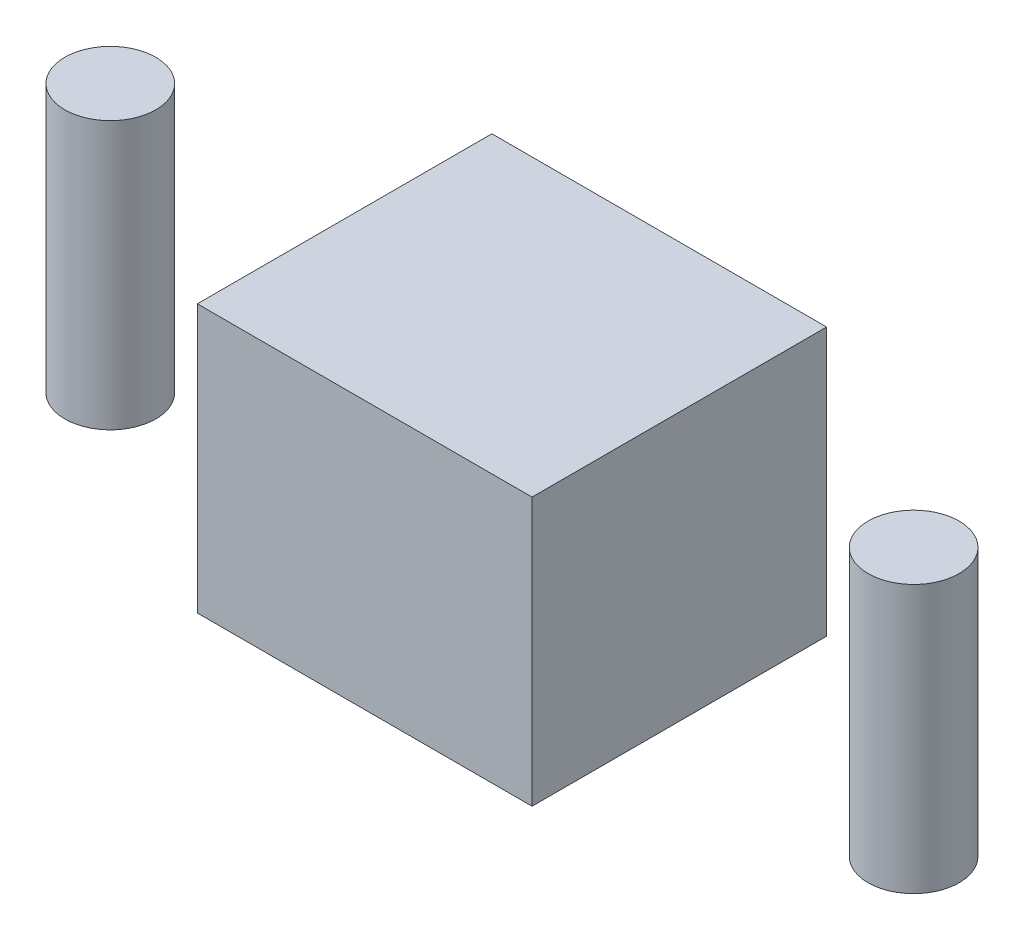
ISO-10303-21;
HEADER;
FILE_DESCRIPTION(('STEP AP214'),'2;1');
FILE_NAME('part.step','',(''),(''),'','','');
FILE_SCHEMA(('AUTOMOTIVE_DESIGN { 1 0 10303 214 1 1 1 1 }'));
ENDSEC;
DATA;
#1=APPLICATION_CONTEXT('core data for automotive mechanical design processes');
#2=APPLICATION_PROTOCOL_DEFINITION('international standard','automotive_design',2000,#1);
#3=PRODUCT_CONTEXT('',#1,'mechanical');
#4=PRODUCT('Part','Part','',(#3));
#5=PRODUCT_RELATED_PRODUCT_CATEGORY('part','',(#4));
#6=PRODUCT_DEFINITION_FORMATION('','',#4);
#7=PRODUCT_DEFINITION_CONTEXT('part definition',#1,'design');
#8=PRODUCT_DEFINITION('design','',#6,#7);
#9=PRODUCT_DEFINITION_SHAPE('','',#8);
#10=(LENGTH_UNIT() NAMED_UNIT(*) SI_UNIT(.MILLI.,.METRE.));
#11=(NAMED_UNIT(*) PLANE_ANGLE_UNIT() SI_UNIT($,.RADIAN.));
#12=(NAMED_UNIT(*) SI_UNIT($,.STERADIAN.) SOLID_ANGLE_UNIT());
#13=UNCERTAINTY_MEASURE_WITH_UNIT(LENGTH_MEASURE(1.E-05),#10,'distance_accuracy_value','');
#14=(GEOMETRIC_REPRESENTATION_CONTEXT(3) GLOBAL_UNCERTAINTY_ASSIGNED_CONTEXT((#13)) GLOBAL_UNIT_ASSIGNED_CONTEXT((#10,
#11,#12)) REPRESENTATION_CONTEXT('',''));
#15=CARTESIAN_POINT('',(0.,0.,0.));
#16=DIRECTION('',(0.,0.,1.));
#17=DIRECTION('',(1.,0.,0.));
#18=AXIS2_PLACEMENT_3D('',#15,#16,#17);
#19=CARTESIAN_POINT('',(-15.,10.,0.));
#20=DIRECTION('',(0.,-1.,0.));
#21=DIRECTION('',(0.,0.,-1.));
#22=AXIS2_PLACEMENT_3D('',#19,#20,#21);
#23=CYLINDRICAL_SURFACE('',#22,1.7);
#24=CARTESIAN_POINT('',(-15.,10.,0.));
#25=DIRECTION('',(0.,1.,0.));
#26=DIRECTION('',(0.,0.,1.));
#27=AXIS2_PLACEMENT_3D('',#24,#25,#26);
#28=CIRCLE('',#27,1.7);
#29=CARTESIAN_POINT('',(-15.,10.,1.7));
#30=VERTEX_POINT('',#29);
#31=EDGE_CURVE('E11',#30,#30,#28,.T.);
#32=ORIENTED_EDGE('',*,*,#31,.F.);
#33=EDGE_LOOP('',(#32));
#34=FACE_BOUND('',#33,.T.);
#35=CARTESIAN_POINT('',(-15.,0.,0.));
#36=DIRECTION('',(0.,1.,0.));
#37=DIRECTION('',(0.,0.,1.));
#38=AXIS2_PLACEMENT_3D('',#35,#36,#37);
#39=CIRCLE('',#38,1.7);
#40=CARTESIAN_POINT('',(-15.,0.,1.7));
#41=VERTEX_POINT('',#40);
#42=EDGE_CURVE('E46',#41,#41,#39,.T.);
#43=ORIENTED_EDGE('',*,*,#42,.T.);
#44=EDGE_LOOP('',(#43));
#45=FACE_BOUND('',#44,.T.);
#46=ADVANCED_FACE('F43',(#34,#45),#23,.T.);
#47=CARTESIAN_POINT('',(-15.,10.,0.));
#48=DIRECTION('',(0.,1.,0.));
#49=DIRECTION('',(0.,0.,1.));
#50=AXIS2_PLACEMENT_3D('',#47,#48,#49);
#51=PLANE('',#50);
#52=ORIENTED_EDGE('',*,*,#31,.T.);
#53=EDGE_LOOP('',(#52));
#54=FACE_BOUND('',#53,.T.);
#55=ADVANCED_FACE('F58',(#54),#51,.T.);
#56=CARTESIAN_POINT('',(-15.,0.,0.));
#57=DIRECTION('',(0.,1.,0.));
#58=DIRECTION('',(0.,0.,1.));
#59=AXIS2_PLACEMENT_3D('',#56,#57,#58);
#60=PLANE('',#59);
#61=ORIENTED_EDGE('',*,*,#42,.F.);
#62=EDGE_LOOP('',(#61));
#63=FACE_BOUND('',#62,.T.);
#64=ADVANCED_FACE('F56',(#63),#60,.F.);
#65=CLOSED_SHELL('',(#46,#55,#64));
#66=MANIFOLD_SOLID_BREP('B2',#65);
#67=CARTESIAN_POINT('',(15.,10.,0.));
#68=DIRECTION('',(0.,-1.,0.));
#69=DIRECTION('',(0.,0.,-1.));
#70=AXIS2_PLACEMENT_3D('',#67,#68,#69);
#71=CYLINDRICAL_SURFACE('',#70,1.7);
#72=CARTESIAN_POINT('',(15.,10.,0.));
#73=DIRECTION('',(0.,1.,0.));
#74=DIRECTION('',(0.,0.,1.));
#75=AXIS2_PLACEMENT_3D('',#72,#73,#74);
#76=CIRCLE('',#75,1.7);
#77=CARTESIAN_POINT('',(15.,10.,1.7));
#78=VERTEX_POINT('',#77);
#79=EDGE_CURVE('E42',#78,#78,#76,.T.);
#80=ORIENTED_EDGE('',*,*,#79,.F.);
#81=EDGE_LOOP('',(#80));
#82=FACE_BOUND('',#81,.T.);
#83=CARTESIAN_POINT('',(15.,0.,0.));
#84=DIRECTION('',(0.,1.,0.));
#85=DIRECTION('',(0.,0.,1.));
#86=AXIS2_PLACEMENT_3D('',#83,#84,#85);
#87=CIRCLE('',#86,1.7);
#88=CARTESIAN_POINT('',(15.,0.,1.7));
#89=VERTEX_POINT('',#88);
#90=EDGE_CURVE('E95',#89,#89,#87,.T.);
#91=ORIENTED_EDGE('',*,*,#90,.T.);
#92=EDGE_LOOP('',(#91));
#93=FACE_BOUND('',#92,.T.);
#94=ADVANCED_FACE('F92',(#82,#93),#71,.T.);
#95=CARTESIAN_POINT('',(15.,10.,0.));
#96=DIRECTION('',(0.,1.,0.));
#97=DIRECTION('',(0.,0.,1.));
#98=AXIS2_PLACEMENT_3D('',#95,#96,#97);
#99=PLANE('',#98);
#100=ORIENTED_EDGE('',*,*,#79,.T.);
#101=EDGE_LOOP('',(#100));
#102=FACE_BOUND('',#101,.T.);
#103=ADVANCED_FACE('F107',(#102),#99,.T.);
#104=CARTESIAN_POINT('',(15.,0.,0.));
#105=DIRECTION('',(0.,1.,0.));
#106=DIRECTION('',(0.,0.,1.));
#107=AXIS2_PLACEMENT_3D('',#104,#105,#106);
#108=PLANE('',#107);
#109=ORIENTED_EDGE('',*,*,#90,.F.);
#110=EDGE_LOOP('',(#109));
#111=FACE_BOUND('',#110,.T.);
#112=ADVANCED_FACE('F105',(#111),#108,.F.);
#113=CLOSED_SHELL('',(#94,#103,#112));
#114=MANIFOLD_SOLID_BREP('B6',#113);
#115=CARTESIAN_POINT('',(6.25,10.,5.5));
#116=DIRECTION('',(-1.,0.,0.));
#117=DIRECTION('',(0.,0.,1.));
#118=AXIS2_PLACEMENT_3D('',#115,#116,#117);
#119=PLANE('',#118);
#120=DIRECTION('',(0.,0.,-1.));
#121=VECTOR('',#120,1.);
#122=CARTESIAN_POINT('',(6.25,0.,5.5));
#123=LINE('',#122,#121);
#124=CARTESIAN_POINT('',(6.25,0.,5.5));
#125=VERTEX_POINT('',#124);
#126=CARTESIAN_POINT('',(6.25,0.,-5.5));
#127=VERTEX_POINT('',#126);
#128=EDGE_CURVE('E195',#125,#127,#123,.T.);
#129=ORIENTED_EDGE('',*,*,#128,.T.);
#130=DIRECTION('',(0.,-1.,0.));
#131=VECTOR('',#130,1.);
#132=CARTESIAN_POINT('',(6.25,10.,-5.5));
#133=LINE('',#132,#131);
#134=CARTESIAN_POINT('',(6.25,10.,-5.5));
#135=VERTEX_POINT('',#134);
#136=EDGE_CURVE('E90',#135,#127,#133,.T.);
#137=ORIENTED_EDGE('',*,*,#136,.F.);
#138=DIRECTION('',(0.,0.,-1.));
#139=VECTOR('',#138,1.);
#140=CARTESIAN_POINT('',(6.25,10.,5.5));
#141=LINE('',#140,#139);
#142=CARTESIAN_POINT('',(6.25,10.,5.5));
#143=VERTEX_POINT('',#142);
#144=EDGE_CURVE('E183',#143,#135,#141,.T.);
#145=ORIENTED_EDGE('',*,*,#144,.F.);
#146=DIRECTION('',(0.,-1.,0.));
#147=VECTOR('',#146,1.);
#148=CARTESIAN_POINT('',(6.25,10.,5.5));
#149=LINE('',#148,#147);
#150=EDGE_CURVE('E191',#143,#125,#149,.T.);
#151=ORIENTED_EDGE('',*,*,#150,.T.);
#152=EDGE_LOOP('',(#129,#137,#145,#151));
#153=FACE_BOUND('',#152,.T.);
#154=ADVANCED_FACE('F132',(#153),#119,.F.);
#155=CARTESIAN_POINT('',(-6.25,10.,-5.5));
#156=DIRECTION('',(0.,0.,1.));
#157=DIRECTION('',(1.,0.,0.));
#158=AXIS2_PLACEMENT_3D('',#155,#156,#157);
#159=PLANE('',#158);
#160=DIRECTION('',(-1.,0.,0.));
#161=VECTOR('',#160,1.);
#162=CARTESIAN_POINT('',(-6.25,0.,-5.5));
#163=LINE('',#162,#161);
#164=CARTESIAN_POINT('',(-6.25,0.,-5.5));
#165=VERTEX_POINT('',#164);
#166=EDGE_CURVE('E187',#127,#165,#163,.T.);
#167=ORIENTED_EDGE('',*,*,#166,.T.);
#168=DIRECTION('',(0.,-1.,0.));
#169=VECTOR('',#168,1.);
#170=CARTESIAN_POINT('',(-6.25,10.,-5.5));
#171=LINE('',#170,#169);
#172=CARTESIAN_POINT('',(-6.25,10.,-5.5));
#173=VERTEX_POINT('',#172);
#174=EDGE_CURVE('E140',#173,#165,#171,.T.);
#175=ORIENTED_EDGE('',*,*,#174,.F.);
#176=DIRECTION('',(-1.,0.,0.));
#177=VECTOR('',#176,1.);
#178=CARTESIAN_POINT('',(-6.25,10.,-5.5));
#179=LINE('',#178,#177);
#180=EDGE_CURVE('E178',#135,#173,#179,.T.);
#181=ORIENTED_EDGE('',*,*,#180,.F.);
#182=ORIENTED_EDGE('',*,*,#136,.T.);
#183=EDGE_LOOP('',(#167,#175,#181,#182));
#184=FACE_BOUND('',#183,.T.);
#185=ADVANCED_FACE('F186',(#184),#159,.F.);
#186=CARTESIAN_POINT('',(-6.25,10.,5.5));
#187=DIRECTION('',(1.,0.,0.));
#188=DIRECTION('',(0.,0.,-1.));
#189=AXIS2_PLACEMENT_3D('',#186,#187,#188);
#190=PLANE('',#189);
#191=DIRECTION('',(0.,0.,1.));
#192=VECTOR('',#191,1.);
#193=CARTESIAN_POINT('',(-6.25,0.,5.5));
#194=LINE('',#193,#192);
#195=CARTESIAN_POINT('',(-6.25,0.,5.5));
#196=VERTEX_POINT('',#195);
#197=EDGE_CURVE('E165',#165,#196,#194,.T.);
#198=ORIENTED_EDGE('',*,*,#197,.T.);
#199=DIRECTION('',(0.,-1.,0.));
#200=VECTOR('',#199,1.);
#201=CARTESIAN_POINT('',(-6.25,10.,5.5));
#202=LINE('',#201,#200);
#203=CARTESIAN_POINT('',(-6.25,10.,5.5));
#204=VERTEX_POINT('',#203);
#205=EDGE_CURVE('E188',#204,#196,#202,.T.);
#206=ORIENTED_EDGE('',*,*,#205,.F.);
#207=DIRECTION('',(0.,0.,1.));
#208=VECTOR('',#207,1.);
#209=CARTESIAN_POINT('',(-6.25,10.,5.5));
#210=LINE('',#209,#208);
#211=EDGE_CURVE('E181',#173,#204,#210,.T.);
#212=ORIENTED_EDGE('',*,*,#211,.F.);
#213=ORIENTED_EDGE('',*,*,#174,.T.);
#214=EDGE_LOOP('',(#198,#206,#212,#213));
#215=FACE_BOUND('',#214,.T.);
#216=ADVANCED_FACE('F189',(#215),#190,.F.);
#217=CARTESIAN_POINT('',(-6.25,10.,5.5));
#218=DIRECTION('',(0.,0.,-1.));
#219=DIRECTION('',(-1.,0.,0.));
#220=AXIS2_PLACEMENT_3D('',#217,#218,#219);
#221=PLANE('',#220);
#222=DIRECTION('',(1.,0.,0.));
#223=VECTOR('',#222,1.);
#224=CARTESIAN_POINT('',(-6.25,0.,5.5));
#225=LINE('',#224,#223);
#226=EDGE_CURVE('E171',#196,#125,#225,.T.);
#227=ORIENTED_EDGE('',*,*,#226,.T.);
#228=ORIENTED_EDGE('',*,*,#150,.F.);
#229=DIRECTION('',(1.,0.,0.));
#230=VECTOR('',#229,1.);
#231=CARTESIAN_POINT('',(-6.25,10.,5.5));
#232=LINE('',#231,#230);
#233=EDGE_CURVE('E148',#204,#143,#232,.T.);
#234=ORIENTED_EDGE('',*,*,#233,.F.);
#235=ORIENTED_EDGE('',*,*,#205,.T.);
#236=EDGE_LOOP('',(#227,#228,#234,#235));
#237=FACE_BOUND('',#236,.T.);
#238=ADVANCED_FACE('F202',(#237),#221,.F.);
#239=CARTESIAN_POINT('',(0.,10.,0.));
#240=DIRECTION('',(0.,-1.,0.));
#241=DIRECTION('',(0.,0.,-1.));
#242=AXIS2_PLACEMENT_3D('',#239,#240,#241);
#243=PLANE('',#242);
#244=ORIENTED_EDGE('',*,*,#144,.T.);
#245=ORIENTED_EDGE('',*,*,#180,.T.);
#246=ORIENTED_EDGE('',*,*,#211,.T.);
#247=ORIENTED_EDGE('',*,*,#233,.T.);
#248=EDGE_LOOP('',(#244,#245,#246,#247));
#249=FACE_BOUND('',#248,.T.);
#250=ADVANCED_FACE('F179',(#249),#243,.F.);
#251=CARTESIAN_POINT('',(0.,0.,0.));
#252=DIRECTION('',(0.,-1.,0.));
#253=DIRECTION('',(0.,0.,-1.));
#254=AXIS2_PLACEMENT_3D('',#251,#252,#253);
#255=PLANE('',#254);
#256=ORIENTED_EDGE('',*,*,#128,.F.);
#257=ORIENTED_EDGE('',*,*,#226,.F.);
#258=ORIENTED_EDGE('',*,*,#197,.F.);
#259=ORIENTED_EDGE('',*,*,#166,.F.);
#260=EDGE_LOOP('',(#256,#257,#258,#259));
#261=FACE_BOUND('',#260,.T.);
#262=ADVANCED_FACE('F205',(#261),#255,.T.);
#263=CLOSED_SHELL('',(#154,#185,#216,#238,#250,#262));
#264=MANIFOLD_SOLID_BREP('B37',#263);
#265=ADVANCED_BREP_SHAPE_REPRESENTATION('',(#18,#66,#114,#264),#14);
#266=SHAPE_DEFINITION_REPRESENTATION(#9,#265);
ENDSEC;
END-ISO-10303-21;
